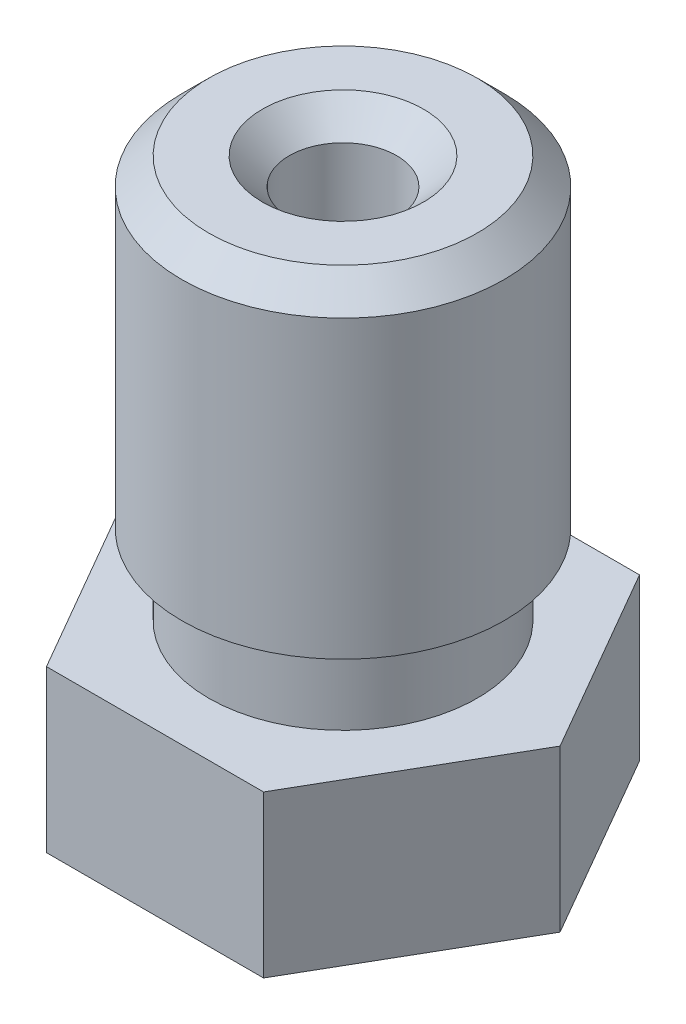
ISO-10303-21;
HEADER;
FILE_DESCRIPTION(('STEP AP214'),'2;1');
FILE_NAME('part.step','',(''),(''),'','','');
FILE_SCHEMA(('AUTOMOTIVE_DESIGN { 1 0 10303 214 1 1 1 1 }'));
ENDSEC;
DATA;
#1=APPLICATION_CONTEXT('core data for automotive mechanical design processes');
#2=APPLICATION_PROTOCOL_DEFINITION('international standard','automotive_design',2000,#1);
#3=PRODUCT_CONTEXT('',#1,'mechanical');
#4=PRODUCT('Part','Part','',(#3));
#5=PRODUCT_RELATED_PRODUCT_CATEGORY('part','',(#4));
#6=PRODUCT_DEFINITION_FORMATION('','',#4);
#7=PRODUCT_DEFINITION_CONTEXT('part definition',#1,'design');
#8=PRODUCT_DEFINITION('design','',#6,#7);
#9=PRODUCT_DEFINITION_SHAPE('','',#8);
#10=(LENGTH_UNIT() NAMED_UNIT(*) SI_UNIT(.MILLI.,.METRE.));
#11=(NAMED_UNIT(*) PLANE_ANGLE_UNIT() SI_UNIT($,.RADIAN.));
#12=(NAMED_UNIT(*) SI_UNIT($,.STERADIAN.) SOLID_ANGLE_UNIT());
#13=UNCERTAINTY_MEASURE_WITH_UNIT(LENGTH_MEASURE(1.E-05),#10,'distance_accuracy_value','');
#14=(GEOMETRIC_REPRESENTATION_CONTEXT(3) GLOBAL_UNCERTAINTY_ASSIGNED_CONTEXT((#13)) GLOBAL_UNIT_ASSIGNED_CONTEXT((#10,
#11,#12)) REPRESENTATION_CONTEXT('',''));
#15=CARTESIAN_POINT('',(0.,0.,0.));
#16=DIRECTION('',(0.,0.,1.));
#17=DIRECTION('',(1.,0.,0.));
#18=AXIS2_PLACEMENT_3D('',#15,#16,#17);
#19=CARTESIAN_POINT('',(2.02072594216369,3.,3.5));
#20=DIRECTION('',(0.,0.,1.));
#21=DIRECTION('',(1.,0.,0.));
#22=AXIS2_PLACEMENT_3D('',#19,#20,#21);
#23=PLANE('',#22);
#24=DIRECTION('',(-1.,0.,0.));
#25=VECTOR('',#24,1.);
#26=CARTESIAN_POINT('',(2.02072594216369,0.,3.5));
#27=LINE('',#26,#25);
#28=CARTESIAN_POINT('',(2.02072594216369,0.,3.5));
#29=VERTEX_POINT('',#28);
#30=CARTESIAN_POINT('',(-2.02072594216369,0.,3.5));
#31=VERTEX_POINT('',#30);
#32=EDGE_CURVE('E120',#29,#31,#27,.T.);
#33=ORIENTED_EDGE('',*,*,#32,.F.);
#34=DIRECTION('',(0.,-1.,0.));
#35=VECTOR('',#34,1.);
#36=CARTESIAN_POINT('',(2.02072594216369,3.,3.5));
#37=LINE('',#36,#35);
#38=CARTESIAN_POINT('',(2.02072594216369,3.,3.5));
#39=VERTEX_POINT('',#38);
#40=EDGE_CURVE('E49',#39,#29,#37,.T.);
#41=ORIENTED_EDGE('',*,*,#40,.F.);
#42=DIRECTION('',(-1.,0.,0.));
#43=VECTOR('',#42,1.);
#44=CARTESIAN_POINT('',(2.02072594216369,3.,3.5));
#45=LINE('',#44,#43);
#46=CARTESIAN_POINT('',(-2.02072594216369,3.,3.5));
#47=VERTEX_POINT('',#46);
#48=EDGE_CURVE('E136',#39,#47,#45,.T.);
#49=ORIENTED_EDGE('',*,*,#48,.T.);
#50=DIRECTION('',(0.,-1.,0.));
#51=VECTOR('',#50,1.);
#52=CARTESIAN_POINT('',(-2.02072594216369,3.,3.5));
#53=LINE('',#52,#51);
#54=EDGE_CURVE('E84',#47,#31,#53,.T.);
#55=ORIENTED_EDGE('',*,*,#54,.T.);
#56=EDGE_LOOP('',(#33,#41,#49,#55));
#57=FACE_BOUND('',#56,.T.);
#58=ADVANCED_FACE('F32',(#57),#23,.T.);
#59=CARTESIAN_POINT('',(4.04145188432738,3.,0.));
#60=DIRECTION('',(0.866025403784439,0.,0.5));
#61=DIRECTION('',(0.5,0.,-0.866025403784439));
#62=AXIS2_PLACEMENT_3D('',#59,#60,#61);
#63=PLANE('',#62);
#64=DIRECTION('',(-0.5,0.,0.866025403784439));
#65=VECTOR('',#64,1.);
#66=CARTESIAN_POINT('',(4.04145188432738,0.,0.));
#67=LINE('',#66,#65);
#68=CARTESIAN_POINT('',(4.04145188432738,0.,0.));
#69=VERTEX_POINT('',#68);
#70=EDGE_CURVE('E133',#69,#29,#67,.T.);
#71=ORIENTED_EDGE('',*,*,#70,.F.);
#72=DIRECTION('',(0.,-1.,0.));
#73=VECTOR('',#72,1.);
#74=CARTESIAN_POINT('',(4.04145188432738,3.,0.));
#75=LINE('',#74,#73);
#76=CARTESIAN_POINT('',(4.04145188432738,3.,0.));
#77=VERTEX_POINT('',#76);
#78=EDGE_CURVE('E72',#77,#69,#75,.T.);
#79=ORIENTED_EDGE('',*,*,#78,.F.);
#80=DIRECTION('',(-0.5,0.,0.866025403784439));
#81=VECTOR('',#80,1.);
#82=CARTESIAN_POINT('',(4.04145188432738,3.,0.));
#83=LINE('',#82,#81);
#84=EDGE_CURVE('E110',#77,#39,#83,.T.);
#85=ORIENTED_EDGE('',*,*,#84,.T.);
#86=ORIENTED_EDGE('',*,*,#40,.T.);
#87=EDGE_LOOP('',(#71,#79,#85,#86));
#88=FACE_BOUND('',#87,.T.);
#89=ADVANCED_FACE('F209',(#88),#63,.T.);
#90=CARTESIAN_POINT('',(2.02072594216369,3.,-3.5));
#91=DIRECTION('',(0.866025403784438,0.,-0.500000000000001));
#92=DIRECTION('',(-0.500000000000001,0.,-0.866025403784438));
#93=AXIS2_PLACEMENT_3D('',#90,#91,#92);
#94=PLANE('',#93);
#95=DIRECTION('',(0.500000000000001,0.,0.866025403784438));
#96=VECTOR('',#95,1.);
#97=CARTESIAN_POINT('',(2.02072594216369,0.,-3.5));
#98=LINE('',#97,#96);
#99=CARTESIAN_POINT('',(2.02072594216369,0.,-3.5));
#100=VERTEX_POINT('',#99);
#101=EDGE_CURVE('E97',#100,#69,#98,.T.);
#102=ORIENTED_EDGE('',*,*,#101,.F.);
#103=DIRECTION('',(0.,-1.,0.));
#104=VECTOR('',#103,1.);
#105=CARTESIAN_POINT('',(2.02072594216369,3.,-3.5));
#106=LINE('',#105,#104);
#107=CARTESIAN_POINT('',(2.02072594216369,3.,-3.5));
#108=VERTEX_POINT('',#107);
#109=EDGE_CURVE('E92',#108,#100,#106,.T.);
#110=ORIENTED_EDGE('',*,*,#109,.F.);
#111=DIRECTION('',(0.500000000000001,0.,0.866025403784438));
#112=VECTOR('',#111,1.);
#113=CARTESIAN_POINT('',(2.02072594216369,3.,-3.5));
#114=LINE('',#113,#112);
#115=EDGE_CURVE('E95',#108,#77,#114,.T.);
#116=ORIENTED_EDGE('',*,*,#115,.T.);
#117=ORIENTED_EDGE('',*,*,#78,.T.);
#118=EDGE_LOOP('',(#102,#110,#116,#117));
#119=FACE_BOUND('',#118,.T.);
#120=ADVANCED_FACE('F94',(#119),#94,.T.);
#121=CARTESIAN_POINT('',(-2.02072594216369,3.,-3.5));
#122=DIRECTION('',(0.,0.,-1.));
#123=DIRECTION('',(-1.,0.,0.));
#124=AXIS2_PLACEMENT_3D('',#121,#122,#123);
#125=PLANE('',#124);
#126=DIRECTION('',(1.,0.,0.));
#127=VECTOR('',#126,1.);
#128=CARTESIAN_POINT('',(-2.02072594216369,0.,-3.5));
#129=LINE('',#128,#127);
#130=CARTESIAN_POINT('',(-2.02072594216369,0.,-3.5));
#131=VERTEX_POINT('',#130);
#132=EDGE_CURVE('E130',#131,#100,#129,.T.);
#133=ORIENTED_EDGE('',*,*,#132,.F.);
#134=DIRECTION('',(0.,-1.,0.));
#135=VECTOR('',#134,1.);
#136=CARTESIAN_POINT('',(-2.02072594216369,3.,-3.5));
#137=LINE('',#136,#135);
#138=CARTESIAN_POINT('',(-2.02072594216369,3.,-3.5));
#139=VERTEX_POINT('',#138);
#140=EDGE_CURVE('E102',#139,#131,#137,.T.);
#141=ORIENTED_EDGE('',*,*,#140,.F.);
#142=DIRECTION('',(1.,0.,0.));
#143=VECTOR('',#142,1.);
#144=CARTESIAN_POINT('',(-2.02072594216369,3.,-3.5));
#145=LINE('',#144,#143);
#146=EDGE_CURVE('E108',#139,#108,#145,.T.);
#147=ORIENTED_EDGE('',*,*,#146,.T.);
#148=ORIENTED_EDGE('',*,*,#109,.T.);
#149=EDGE_LOOP('',(#133,#141,#147,#148));
#150=FACE_BOUND('',#149,.T.);
#151=ADVANCED_FACE('F112',(#150),#125,.T.);
#152=CARTESIAN_POINT('',(-4.04145188432738,3.,0.));
#153=DIRECTION('',(-0.866025403784439,0.,-0.5));
#154=DIRECTION('',(-0.5,0.,0.866025403784439));
#155=AXIS2_PLACEMENT_3D('',#152,#153,#154);
#156=PLANE('',#155);
#157=DIRECTION('',(0.5,0.,-0.866025403784439));
#158=VECTOR('',#157,1.);
#159=CARTESIAN_POINT('',(-4.04145188432738,0.,0.));
#160=LINE('',#159,#158);
#161=CARTESIAN_POINT('',(-4.04145188432738,0.,0.));
#162=VERTEX_POINT('',#161);
#163=EDGE_CURVE('E127',#162,#131,#160,.T.);
#164=ORIENTED_EDGE('',*,*,#163,.F.);
#165=DIRECTION('',(0.,-1.,0.));
#166=VECTOR('',#165,1.);
#167=CARTESIAN_POINT('',(-4.04145188432738,3.,0.));
#168=LINE('',#167,#166);
#169=CARTESIAN_POINT('',(-4.04145188432738,3.,0.));
#170=VERTEX_POINT('',#169);
#171=EDGE_CURVE('E141',#170,#162,#168,.T.);
#172=ORIENTED_EDGE('',*,*,#171,.F.);
#173=DIRECTION('',(0.5,0.,-0.866025403784439));
#174=VECTOR('',#173,1.);
#175=CARTESIAN_POINT('',(-4.04145188432738,3.,0.));
#176=LINE('',#175,#174);
#177=EDGE_CURVE('E113',#170,#139,#176,.T.);
#178=ORIENTED_EDGE('',*,*,#177,.T.);
#179=ORIENTED_EDGE('',*,*,#140,.T.);
#180=EDGE_LOOP('',(#164,#172,#178,#179));
#181=FACE_BOUND('',#180,.T.);
#182=ADVANCED_FACE('F223',(#181),#156,.T.);
#183=CARTESIAN_POINT('',(-2.02072594216369,3.,3.5));
#184=DIRECTION('',(-0.866025403784439,0.,0.5));
#185=DIRECTION('',(0.5,0.,0.866025403784439));
#186=AXIS2_PLACEMENT_3D('',#183,#184,#185);
#187=PLANE('',#186);
#188=DIRECTION('',(-0.5,0.,-0.866025403784439));
#189=VECTOR('',#188,1.);
#190=CARTESIAN_POINT('',(-2.02072594216369,0.,3.5));
#191=LINE('',#190,#189);
#192=EDGE_CURVE('E123',#31,#162,#191,.T.);
#193=ORIENTED_EDGE('',*,*,#192,.F.);
#194=ORIENTED_EDGE('',*,*,#54,.F.);
#195=DIRECTION('',(-0.5,0.,-0.866025403784439));
#196=VECTOR('',#195,1.);
#197=CARTESIAN_POINT('',(-2.02072594216369,3.,3.5));
#198=LINE('',#197,#196);
#199=EDGE_CURVE('E115',#47,#170,#198,.T.);
#200=ORIENTED_EDGE('',*,*,#199,.T.);
#201=ORIENTED_EDGE('',*,*,#171,.T.);
#202=EDGE_LOOP('',(#193,#194,#200,#201));
#203=FACE_BOUND('',#202,.T.);
#204=ADVANCED_FACE('F205',(#203),#187,.T.);
#205=CARTESIAN_POINT('',(0.,3.,0.));
#206=DIRECTION('',(0.,-1.,0.));
#207=DIRECTION('',(0.,0.,-1.));
#208=AXIS2_PLACEMENT_3D('',#205,#206,#207);
#209=PLANE('',#208);
#210=CARTESIAN_POINT('',(0.,3.,0.));
#211=DIRECTION('',(0.,1.,0.));
#212=DIRECTION('',(0.,0.,1.));
#213=AXIS2_PLACEMENT_3D('',#210,#211,#212);
#214=CIRCLE('',#213,2.5);
#215=CARTESIAN_POINT('',(0.,3.,2.5));
#216=VERTEX_POINT('',#215);
#217=EDGE_CURVE('E124',#216,#216,#214,.T.);
#218=ORIENTED_EDGE('',*,*,#217,.F.);
#219=EDGE_LOOP('',(#218));
#220=FACE_BOUND('',#219,.T.);
#221=ORIENTED_EDGE('',*,*,#48,.F.);
#222=ORIENTED_EDGE('',*,*,#84,.F.);
#223=ORIENTED_EDGE('',*,*,#115,.F.);
#224=ORIENTED_EDGE('',*,*,#146,.F.);
#225=ORIENTED_EDGE('',*,*,#177,.F.);
#226=ORIENTED_EDGE('',*,*,#199,.F.);
#227=EDGE_LOOP('',(#221,#222,#223,#224,#225,#226));
#228=FACE_BOUND('',#227,.T.);
#229=ADVANCED_FACE('F106',(#220,#228),#209,.F.);
#230=CARTESIAN_POINT('',(0.,0.,0.));
#231=DIRECTION('',(0.,-1.,0.));
#232=DIRECTION('',(0.,0.,-1.));
#233=AXIS2_PLACEMENT_3D('',#230,#231,#232);
#234=PLANE('',#233);
#235=CARTESIAN_POINT('',(0.,0.,0.));
#236=DIRECTION('',(0.,-1.,0.));
#237=DIRECTION('',(0.,0.,-1.));
#238=AXIS2_PLACEMENT_3D('',#235,#236,#237);
#239=CIRCLE('',#238,2.50000000004502);
#240=CARTESIAN_POINT('',(0.,0.,-2.50000000004502));
#241=VERTEX_POINT('',#240);
#242=EDGE_CURVE('E138',#241,#241,#239,.T.);
#243=ORIENTED_EDGE('',*,*,#242,.F.);
#244=EDGE_LOOP('',(#243));
#245=FACE_BOUND('',#244,.T.);
#246=ORIENTED_EDGE('',*,*,#32,.T.);
#247=ORIENTED_EDGE('',*,*,#192,.T.);
#248=ORIENTED_EDGE('',*,*,#163,.T.);
#249=ORIENTED_EDGE('',*,*,#132,.T.);
#250=ORIENTED_EDGE('',*,*,#101,.T.);
#251=ORIENTED_EDGE('',*,*,#70,.T.);
#252=EDGE_LOOP('',(#246,#247,#248,#249,#250,#251));
#253=FACE_BOUND('',#252,.T.);
#254=ADVANCED_FACE('F208',(#245,#253),#234,.T.);
#255=CARTESIAN_POINT('',(0.,3.,0.));
#256=DIRECTION('',(0.,1.,0.));
#257=DIRECTION('',(0.,0.,1.));
#258=AXIS2_PLACEMENT_3D('',#255,#256,#257);
#259=CYLINDRICAL_SURFACE('',#258,2.5);
#260=ORIENTED_EDGE('',*,*,#217,.T.);
#261=EDGE_LOOP('',(#260));
#262=FACE_BOUND('',#261,.T.);
#263=CARTESIAN_POINT('',(0.,4.5,0.));
#264=DIRECTION('',(0.,1.,0.));
#265=DIRECTION('',(0.,0.,1.));
#266=AXIS2_PLACEMENT_3D('',#263,#264,#265);
#267=CIRCLE('',#266,2.5);
#268=CARTESIAN_POINT('',(0.,4.5,2.5));
#269=VERTEX_POINT('',#268);
#270=EDGE_CURVE('E197',#269,#269,#267,.T.);
#271=ORIENTED_EDGE('',*,*,#270,.F.);
#272=EDGE_LOOP('',(#271));
#273=FACE_BOUND('',#272,.T.);
#274=ADVANCED_FACE('F166',(#262,#273),#259,.T.);
#275=CARTESIAN_POINT('',(0.,10.5,0.));
#276=DIRECTION('',(0.,1.,0.));
#277=DIRECTION('',(0.,0.,1.));
#278=AXIS2_PLACEMENT_3D('',#275,#276,#277);
#279=PLANE('',#278);
#280=CARTESIAN_POINT('',(0.,10.5,0.));
#281=DIRECTION('',(0.,1.,0.));
#282=DIRECTION('',(0.,0.,1.));
#283=AXIS2_PLACEMENT_3D('',#280,#281,#282);
#284=CIRCLE('',#283,2.4999999999834);
#285=CARTESIAN_POINT('',(0.,10.5,2.4999999999834));
#286=VERTEX_POINT('',#285);
#287=EDGE_CURVE('E149',#286,#286,#284,.T.);
#288=ORIENTED_EDGE('',*,*,#287,.T.);
#289=EDGE_LOOP('',(#288));
#290=FACE_BOUND('',#289,.T.);
#291=CARTESIAN_POINT('',(-1.10963134903613E-11,10.5,0.));
#292=DIRECTION('',(0.,1.,0.));
#293=DIRECTION('',(0.,0.,1.));
#294=AXIS2_PLACEMENT_3D('',#291,#292,#293);
#295=CIRCLE('',#294,1.5000000000277);
#296=CARTESIAN_POINT('',(-1.10963134903613E-11,10.5,1.5000000000277));
#297=VERTEX_POINT('',#296);
#298=EDGE_CURVE('E146',#297,#297,#295,.F.);
#299=ORIENTED_EDGE('',*,*,#298,.T.);
#300=EDGE_LOOP('',(#299));
#301=FACE_BOUND('',#300,.T.);
#302=ADVANCED_FACE('F163',(#290,#301),#279,.T.);
#303=CARTESIAN_POINT('',(0.,3.,0.));
#304=DIRECTION('',(0.,1.,0.));
#305=DIRECTION('',(0.,0.,1.));
#306=AXIS2_PLACEMENT_3D('',#303,#304,#305);
#307=CYLINDRICAL_SURFACE('',#306,3.);
#308=CARTESIAN_POINT('',(0.,9.9999999999834,0.));
#309=DIRECTION('',(0.,1.,0.));
#310=DIRECTION('',(0.,0.,1.));
#311=AXIS2_PLACEMENT_3D('',#308,#309,#310);
#312=CIRCLE('',#311,3.);
#313=CARTESIAN_POINT('',(0.,9.9999999999834,3.));
#314=VERTEX_POINT('',#313);
#315=EDGE_CURVE('E41',#314,#314,#312,.F.);
#316=ORIENTED_EDGE('',*,*,#315,.T.);
#317=EDGE_LOOP('',(#316));
#318=FACE_BOUND('',#317,.T.);
#319=CARTESIAN_POINT('',(0.,4.5,0.));
#320=DIRECTION('',(0.,1.,0.));
#321=DIRECTION('',(0.,0.,1.));
#322=AXIS2_PLACEMENT_3D('',#319,#320,#321);
#323=CIRCLE('',#322,3.);
#324=CARTESIAN_POINT('',(0.,4.5,3.));
#325=VERTEX_POINT('',#324);
#326=EDGE_CURVE('E200',#325,#325,#323,.T.);
#327=ORIENTED_EDGE('',*,*,#326,.T.);
#328=EDGE_LOOP('',(#327));
#329=FACE_BOUND('',#328,.T.);
#330=ADVANCED_FACE('F154',(#318,#329),#307,.T.);
#331=CARTESIAN_POINT('',(3.,4.5,0.));
#332=DIRECTION('',(0.,-1.,0.));
#333=DIRECTION('',(0.,0.,-1.));
#334=AXIS2_PLACEMENT_3D('',#331,#332,#333);
#335=PLANE('',#334);
#336=ORIENTED_EDGE('',*,*,#270,.T.);
#337=EDGE_LOOP('',(#336));
#338=FACE_BOUND('',#337,.T.);
#339=ORIENTED_EDGE('',*,*,#326,.F.);
#340=EDGE_LOOP('',(#339));
#341=FACE_BOUND('',#340,.T.);
#342=ADVANCED_FACE('F243',(#338,#341),#335,.T.);
#343=CARTESIAN_POINT('',(0.,-2.,0.));
#344=DIRECTION('',(0.,1.,0.));
#345=DIRECTION('',(-1.,0.,0.));
#346=AXIS2_PLACEMENT_3D('',#343,#344,#345);
#347=CONICAL_SURFACE('',#346,0.50000000004502,0.785398163397449);
#348=ORIENTED_EDGE('',*,*,#242,.T.);
#349=EDGE_LOOP('',(#348));
#350=FACE_BOUND('',#349,.T.);
#351=CARTESIAN_POINT('',(0.,-2.,0.));
#352=DIRECTION('',(0.,-1.,0.));
#353=DIRECTION('',(1.,0.,0.));
#354=AXIS2_PLACEMENT_3D('',#351,#352,#353);
#355=CIRCLE('',#354,0.50000000004502);
#356=CARTESIAN_POINT('',(0.50000000004502,-2.,0.));
#357=VERTEX_POINT('',#356);
#358=EDGE_CURVE('E188',#357,#357,#355,.T.);
#359=ORIENTED_EDGE('',*,*,#358,.F.);
#360=EDGE_LOOP('',(#359));
#361=FACE_BOUND('',#360,.T.);
#362=ADVANCED_FACE('F246',(#350,#361),#347,.T.);
#363=CARTESIAN_POINT('',(0.,-2.,0.));
#364=DIRECTION('',(0.,-1.,0.));
#365=DIRECTION('',(1.,0.,0.));
#366=AXIS2_PLACEMENT_3D('',#363,#364,#365);
#367=PLANE('',#366);
#368=CARTESIAN_POINT('',(-1.10963134903613E-11,-2.,0.));
#369=DIRECTION('',(0.,1.,0.));
#370=DIRECTION('',(0.,0.,1.));
#371=AXIS2_PLACEMENT_3D('',#368,#369,#370);
#372=CIRCLE('',#371,0.2);
#373=CARTESIAN_POINT('',(-1.10963134903613E-11,-2.,0.2));
#374=VERTEX_POINT('',#373);
#375=EDGE_CURVE('E184',#374,#374,#372,.T.);
#376=ORIENTED_EDGE('',*,*,#375,.T.);
#377=EDGE_LOOP('',(#376));
#378=FACE_BOUND('',#377,.T.);
#379=ORIENTED_EDGE('',*,*,#358,.T.);
#380=EDGE_LOOP('',(#379));
#381=FACE_BOUND('',#380,.T.);
#382=ADVANCED_FACE('F250',(#378,#381),#367,.T.);
#383=CARTESIAN_POINT('',(-1.10963134903613E-11,-2.,0.));
#384=DIRECTION('',(0.,1.,0.));
#385=DIRECTION('',(0.,0.,1.));
#386=AXIS2_PLACEMENT_3D('',#383,#384,#385);
#387=CYLINDRICAL_SURFACE('',#386,0.2);
#388=ORIENTED_EDGE('',*,*,#375,.F.);
#389=EDGE_LOOP('',(#388));
#390=FACE_BOUND('',#389,.T.);
#391=CARTESIAN_POINT('',(-1.10963134903613E-11,-1.20000000003984,0.));
#392=DIRECTION('',(0.,1.,0.));
#393=DIRECTION('',(0.,0.,1.));
#394=AXIS2_PLACEMENT_3D('',#391,#392,#393);
#395=CIRCLE('',#394,0.2);
#396=CARTESIAN_POINT('',(-1.10963134903613E-11,-1.20000000003984,0.2));
#397=VERTEX_POINT('',#396);
#398=EDGE_CURVE('E272',#397,#397,#395,.T.);
#399=ORIENTED_EDGE('',*,*,#398,.T.);
#400=EDGE_LOOP('',(#399));
#401=FACE_BOUND('',#400,.T.);
#402=ADVANCED_FACE('F178',(#390,#401),#387,.F.);
#403=CARTESIAN_POINT('',(-1.10963134903613E-11,-2.,0.));
#404=DIRECTION('',(0.,1.,0.));
#405=DIRECTION('',(0.,0.,1.));
#406=AXIS2_PLACEMENT_3D('',#403,#404,#405);
#407=CYLINDRICAL_SURFACE('',#406,1.0000000000111);
#408=CARTESIAN_POINT('',(-1.10963134903613E-11,9.9999999999834,0.));
#409=DIRECTION('',(0.,1.,0.));
#410=DIRECTION('',(0.,0.,1.));
#411=AXIS2_PLACEMENT_3D('',#408,#409,#410);
#412=CIRCLE('',#411,1.0000000000111);
#413=CARTESIAN_POINT('',(-1.10963134903613E-11,9.9999999999834,1.0000000000111));
#414=VERTEX_POINT('',#413);
#415=EDGE_CURVE('E11',#414,#414,#412,.T.);
#416=ORIENTED_EDGE('',*,*,#415,.T.);
#417=EDGE_LOOP('',(#416));
#418=FACE_BOUND('',#417,.T.);
#419=CARTESIAN_POINT('',(-1.10963134903613E-11,0.,0.));
#420=DIRECTION('',(0.,1.,0.));
#421=DIRECTION('',(0.,0.,1.));
#422=AXIS2_PLACEMENT_3D('',#419,#420,#421);
#423=CIRCLE('',#422,1.0000000000111);
#424=CARTESIAN_POINT('',(-1.10963134903613E-11,0.,1.0000000000111));
#425=VERTEX_POINT('',#424);
#426=EDGE_CURVE('E182',#425,#425,#423,.T.);
#427=ORIENTED_EDGE('',*,*,#426,.F.);
#428=EDGE_LOOP('',(#427));
#429=FACE_BOUND('',#428,.T.);
#430=ADVANCED_FACE('F174',(#418,#429),#407,.F.);
#431=CARTESIAN_POINT('',(-1.10963134903613E-11,0.,0.));
#432=DIRECTION('',(0.,1.,0.));
#433=DIRECTION('',(0.,0.,1.));
#434=AXIS2_PLACEMENT_3D('',#431,#432,#433);
#435=CONICAL_SURFACE('',#434,1.0000000000111,0.832981266710198);
#436=CARTESIAN_POINT('',(-1.10963134903613E-11,-0.227272727272521,0.));
#437=DIRECTION('',(0.,1.,0.));
#438=DIRECTION('',(0.,0.,1.));
#439=AXIS2_PLACEMENT_3D('',#436,#437,#438);
#440=CIRCLE('',#439,0.749999999993361);
#441=CARTESIAN_POINT('',(-1.10963134903613E-11,-0.227272727272521,0.749999999993361));
#442=VERTEX_POINT('',#441);
#443=EDGE_CURVE('E185',#442,#442,#440,.T.);
#444=ORIENTED_EDGE('',*,*,#443,.F.);
#445=EDGE_LOOP('',(#444));
#446=FACE_BOUND('',#445,.T.);
#447=ORIENTED_EDGE('',*,*,#426,.T.);
#448=EDGE_LOOP('',(#447));
#449=FACE_BOUND('',#448,.T.);
#450=ADVANCED_FACE('F177',(#446,#449),#435,.F.);
#451=CARTESIAN_POINT('',(-1.10963134903613E-11,-2.,0.));
#452=DIRECTION('',(0.,1.,0.));
#453=DIRECTION('',(0.,0.,1.));
#454=AXIS2_PLACEMENT_3D('',#451,#452,#453);
#455=CYLINDRICAL_SURFACE('',#454,0.749999999993361);
#456=CARTESIAN_POINT('',(-1.10963134903613E-11,-0.700000000000002,0.));
#457=DIRECTION('',(0.,1.,0.));
#458=DIRECTION('',(0.,0.,1.));
#459=AXIS2_PLACEMENT_3D('',#456,#457,#458);
#460=CIRCLE('',#459,0.749999999993361);
#461=CARTESIAN_POINT('',(-1.10963134903613E-11,-0.700000000000002,0.749999999993361));
#462=VERTEX_POINT('',#461);
#463=EDGE_CURVE('E191',#462,#462,#460,.T.);
#464=ORIENTED_EDGE('',*,*,#463,.F.);
#465=EDGE_LOOP('',(#464));
#466=FACE_BOUND('',#465,.T.);
#467=ORIENTED_EDGE('',*,*,#443,.T.);
#468=EDGE_LOOP('',(#467));
#469=FACE_BOUND('',#468,.T.);
#470=ADVANCED_FACE('F260',(#466,#469),#455,.F.);
#471=CARTESIAN_POINT('',(-1.10963134903613E-11,-0.700000000000002,0.));
#472=DIRECTION('',(0.,1.,0.));
#473=DIRECTION('',(0.,0.,1.));
#474=AXIS2_PLACEMENT_3D('',#471,#472,#473);
#475=CONICAL_SURFACE('',#474,0.749999999993361,0.832981266628769);
#476=ORIENTED_EDGE('',*,*,#398,.F.);
#477=EDGE_LOOP('',(#476));
#478=FACE_BOUND('',#477,.T.);
#479=ORIENTED_EDGE('',*,*,#463,.T.);
#480=EDGE_LOOP('',(#479));
#481=FACE_BOUND('',#480,.T.);
#482=ADVANCED_FACE('F160',(#478,#481),#475,.F.);
#483=CARTESIAN_POINT('',(0.,10.5,0.));
#484=DIRECTION('',(0.,-1.,0.));
#485=DIRECTION('',(0.,0.,-1.));
#486=AXIS2_PLACEMENT_3D('',#483,#484,#485);
#487=CONICAL_SURFACE('',#486,2.4999999999834,0.785398163397446);
#488=ORIENTED_EDGE('',*,*,#315,.F.);
#489=EDGE_LOOP('',(#488));
#490=FACE_BOUND('',#489,.T.);
#491=ORIENTED_EDGE('',*,*,#287,.F.);
#492=EDGE_LOOP('',(#491));
#493=FACE_BOUND('',#492,.T.);
#494=ADVANCED_FACE('F157',(#490,#493),#487,.T.);
#495=CARTESIAN_POINT('',(-1.10963134903613E-11,9.9999999999834,0.));
#496=DIRECTION('',(0.,1.,0.));
#497=DIRECTION('',(0.,0.,1.));
#498=AXIS2_PLACEMENT_3D('',#495,#496,#497);
#499=CONICAL_SURFACE('',#498,1.0000000000111,0.785398163397452);
#500=ORIENTED_EDGE('',*,*,#298,.F.);
#501=EDGE_LOOP('',(#500));
#502=FACE_BOUND('',#501,.T.);
#503=ORIENTED_EDGE('',*,*,#415,.F.);
#504=EDGE_LOOP('',(#503));
#505=FACE_BOUND('',#504,.T.);
#506=ADVANCED_FACE('F34',(#502,#505),#499,.F.);
#507=CLOSED_SHELL('',(#58,#89,#120,#151,#182,#204,#229,#254,#274,#302,#330,#342,#362,#382,#402,
#430,#450,#470,#482,#494,#506));
#508=MANIFOLD_SOLID_BREP('B2',#507);
#509=ADVANCED_BREP_SHAPE_REPRESENTATION('',(#18,#508),#14);
#510=SHAPE_DEFINITION_REPRESENTATION(#9,#509);
ENDSEC;
END-ISO-10303-21;
